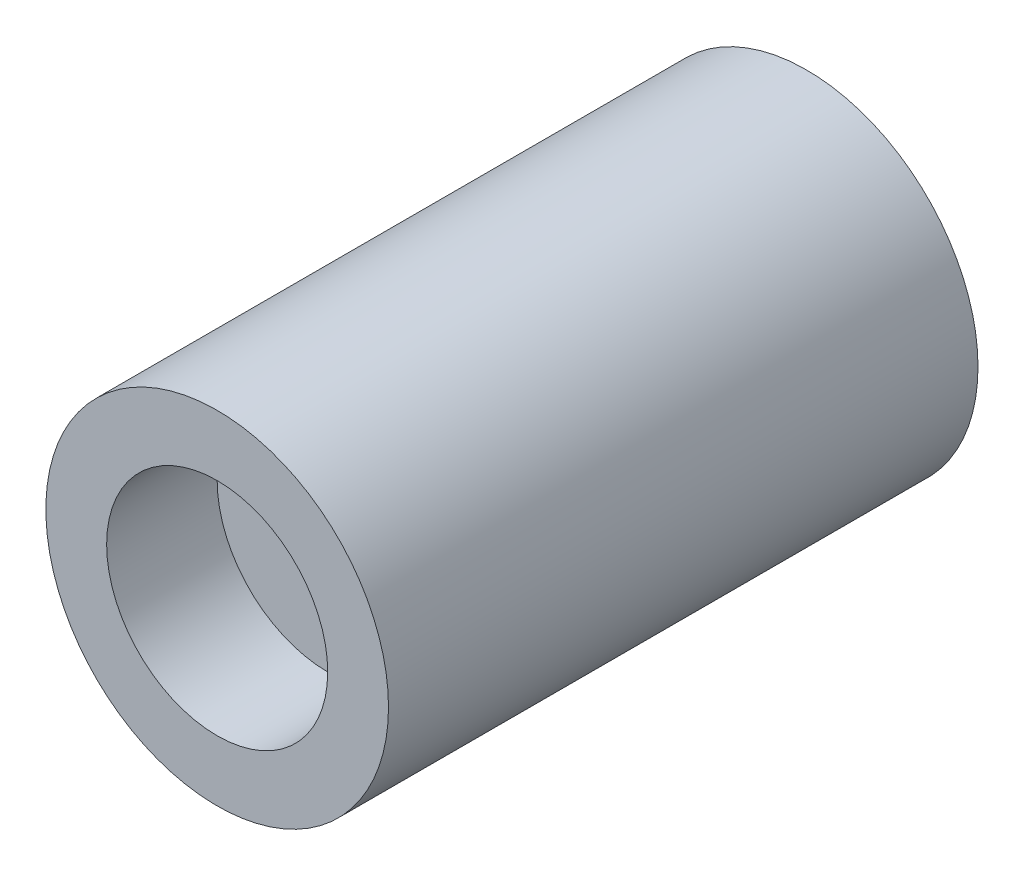
ISO-10303-21;
HEADER;
FILE_DESCRIPTION(('STEP AP214'),'2;1');
FILE_NAME('part.step','',(''),(''),'','','');
FILE_SCHEMA(('AUTOMOTIVE_DESIGN { 1 0 10303 214 1 1 1 1 }'));
ENDSEC;
DATA;
#1=APPLICATION_CONTEXT('core data for automotive mechanical design processes');
#2=APPLICATION_PROTOCOL_DEFINITION('international standard','automotive_design',2000,#1);
#3=PRODUCT_CONTEXT('',#1,'mechanical');
#4=PRODUCT('Part','Part','',(#3));
#5=PRODUCT_RELATED_PRODUCT_CATEGORY('part','',(#4));
#6=PRODUCT_DEFINITION_FORMATION('','',#4);
#7=PRODUCT_DEFINITION_CONTEXT('part definition',#1,'design');
#8=PRODUCT_DEFINITION('design','',#6,#7);
#9=PRODUCT_DEFINITION_SHAPE('','',#8);
#10=(LENGTH_UNIT() NAMED_UNIT(*) SI_UNIT(.MILLI.,.METRE.));
#11=(NAMED_UNIT(*) PLANE_ANGLE_UNIT() SI_UNIT($,.RADIAN.));
#12=(NAMED_UNIT(*) SI_UNIT($,.STERADIAN.) SOLID_ANGLE_UNIT());
#13=UNCERTAINTY_MEASURE_WITH_UNIT(LENGTH_MEASURE(1.E-05),#10,'distance_accuracy_value','');
#14=(GEOMETRIC_REPRESENTATION_CONTEXT(3) GLOBAL_UNCERTAINTY_ASSIGNED_CONTEXT((#13)) GLOBAL_UNIT_ASSIGNED_CONTEXT((#10,
#11,#12)) REPRESENTATION_CONTEXT('',''));
#15=CARTESIAN_POINT('',(0.,0.,0.));
#16=DIRECTION('',(0.,0.,1.));
#17=DIRECTION('',(1.,0.,0.));
#18=AXIS2_PLACEMENT_3D('',#15,#16,#17);
#19=CARTESIAN_POINT('',(0.,0.,80.));
#20=DIRECTION('',(0.,0.,-1.));
#21=DIRECTION('',(-1.,0.,0.));
#22=AXIS2_PLACEMENT_3D('',#19,#20,#21);
#23=CYLINDRICAL_SURFACE('',#22,23.25);
#24=CARTESIAN_POINT('',(0.,0.,80.));
#25=DIRECTION('',(0.,0.,1.));
#26=DIRECTION('',(1.,0.,0.));
#27=AXIS2_PLACEMENT_3D('',#24,#25,#26);
#28=CIRCLE('',#27,23.25);
#29=CARTESIAN_POINT('',(23.25,0.,80.));
#30=VERTEX_POINT('',#29);
#31=EDGE_CURVE('E10',#30,#30,#28,.T.);
#32=ORIENTED_EDGE('',*,*,#31,.F.);
#33=EDGE_LOOP('',(#32));
#34=FACE_BOUND('',#33,.T.);
#35=CARTESIAN_POINT('',(0.,0.,0.));
#36=DIRECTION('',(0.,0.,1.));
#37=DIRECTION('',(1.,0.,0.));
#38=AXIS2_PLACEMENT_3D('',#35,#36,#37);
#39=CIRCLE('',#38,23.25);
#40=CARTESIAN_POINT('',(23.25,0.,0.));
#41=VERTEX_POINT('',#40);
#42=EDGE_CURVE('E40',#41,#41,#39,.T.);
#43=ORIENTED_EDGE('',*,*,#42,.T.);
#44=EDGE_LOOP('',(#43));
#45=FACE_BOUND('',#44,.T.);
#46=ADVANCED_FACE('F37',(#34,#45),#23,.T.);
#47=CARTESIAN_POINT('',(0.,0.,80.));
#48=DIRECTION('',(0.,0.,1.));
#49=DIRECTION('',(1.,0.,0.));
#50=AXIS2_PLACEMENT_3D('',#47,#48,#49);
#51=PLANE('',#50);
#52=CARTESIAN_POINT('',(0.,0.,80.));
#53=DIRECTION('',(0.,0.,1.));
#54=DIRECTION('',(1.,0.,0.));
#55=AXIS2_PLACEMENT_3D('',#52,#53,#54);
#56=CIRCLE('',#55,15.);
#57=CARTESIAN_POINT('',(15.,0.,80.));
#58=VERTEX_POINT('',#57);
#59=EDGE_CURVE('E51',#58,#58,#56,.T.);
#60=ORIENTED_EDGE('',*,*,#59,.F.);
#61=EDGE_LOOP('',(#60));
#62=FACE_BOUND('',#61,.T.);
#63=ORIENTED_EDGE('',*,*,#31,.T.);
#64=EDGE_LOOP('',(#63));
#65=FACE_BOUND('',#64,.T.);
#66=ADVANCED_FACE('F68',(#62,#65),#51,.T.);
#67=CARTESIAN_POINT('',(0.,0.,0.));
#68=DIRECTION('',(0.,0.,1.));
#69=DIRECTION('',(1.,0.,0.));
#70=AXIS2_PLACEMENT_3D('',#67,#68,#69);
#71=PLANE('',#70);
#72=ORIENTED_EDGE('',*,*,#42,.F.);
#73=EDGE_LOOP('',(#72));
#74=FACE_BOUND('',#73,.T.);
#75=ADVANCED_FACE('F64',(#74),#71,.F.);
#76=CARTESIAN_POINT('',(0.,0.,65.));
#77=DIRECTION('',(0.,0.,1.));
#78=DIRECTION('',(1.,0.,0.));
#79=AXIS2_PLACEMENT_3D('',#76,#77,#78);
#80=CYLINDRICAL_SURFACE('',#79,15.);
#81=CARTESIAN_POINT('',(0.,0.,65.));
#82=DIRECTION('',(0.,0.,1.));
#83=DIRECTION('',(1.,0.,0.));
#84=AXIS2_PLACEMENT_3D('',#81,#82,#83);
#85=CIRCLE('',#84,15.);
#86=CARTESIAN_POINT('',(15.,0.,65.));
#87=VERTEX_POINT('',#86);
#88=EDGE_CURVE('E49',#87,#87,#85,.T.);
#89=ORIENTED_EDGE('',*,*,#88,.F.);
#90=EDGE_LOOP('',(#89));
#91=FACE_BOUND('',#90,.T.);
#92=ORIENTED_EDGE('',*,*,#59,.T.);
#93=EDGE_LOOP('',(#92));
#94=FACE_BOUND('',#93,.T.);
#95=ADVANCED_FACE('F61',(#91,#94),#80,.F.);
#96=CARTESIAN_POINT('',(0.,0.,65.));
#97=DIRECTION('',(0.,0.,1.));
#98=DIRECTION('',(1.,0.,0.));
#99=AXIS2_PLACEMENT_3D('',#96,#97,#98);
#100=PLANE('',#99);
#101=ORIENTED_EDGE('',*,*,#88,.T.);
#102=EDGE_LOOP('',(#101));
#103=FACE_BOUND('',#102,.T.);
#104=ADVANCED_FACE('F59',(#103),#100,.T.);
#105=CLOSED_SHELL('',(#46,#66,#75,#95,#104));
#106=MANIFOLD_SOLID_BREP('B2',#105);
#107=ADVANCED_BREP_SHAPE_REPRESENTATION('',(#18,#106),#14);
#108=SHAPE_DEFINITION_REPRESENTATION(#9,#107);
ENDSEC;
END-ISO-10303-21;
